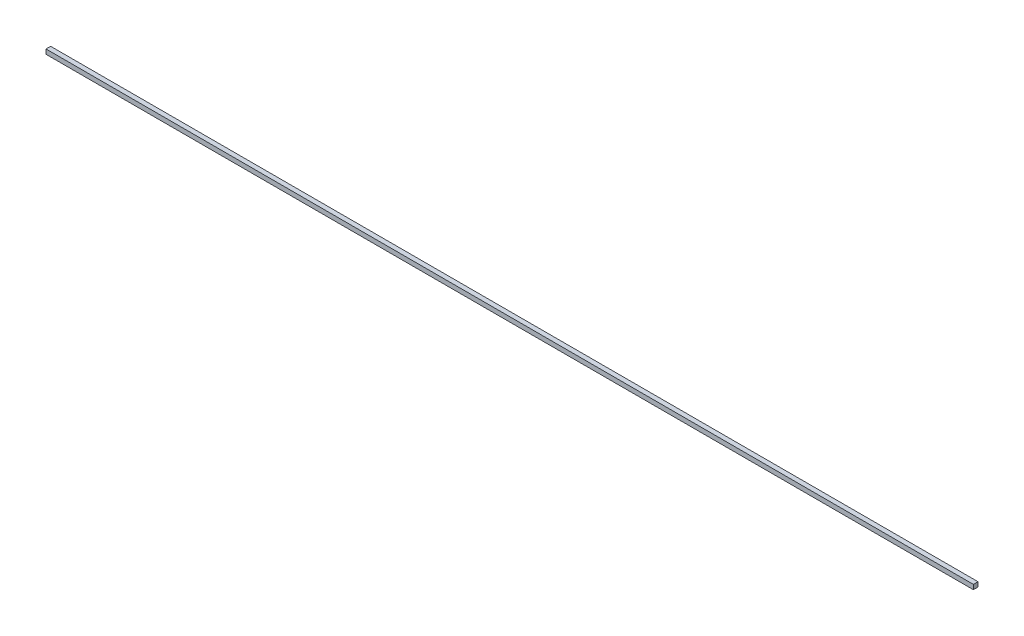
ISO-10303-21;
HEADER;
FILE_DESCRIPTION(('STEP AP214'),'2;1');
FILE_NAME('part.step','',(''),(''),'','','');
FILE_SCHEMA(('AUTOMOTIVE_DESIGN { 1 0 10303 214 1 1 1 1 }'));
ENDSEC;
DATA;
#1=APPLICATION_CONTEXT('core data for automotive mechanical design processes');
#2=APPLICATION_PROTOCOL_DEFINITION('international standard','automotive_design',2000,#1);
#3=PRODUCT_CONTEXT('',#1,'mechanical');
#4=PRODUCT('Part','Part','',(#3));
#5=PRODUCT_RELATED_PRODUCT_CATEGORY('part','',(#4));
#6=PRODUCT_DEFINITION_FORMATION('','',#4);
#7=PRODUCT_DEFINITION_CONTEXT('part definition',#1,'design');
#8=PRODUCT_DEFINITION('design','',#6,#7);
#9=PRODUCT_DEFINITION_SHAPE('','',#8);
#10=(LENGTH_UNIT() NAMED_UNIT(*) SI_UNIT(.MILLI.,.METRE.));
#11=(NAMED_UNIT(*) PLANE_ANGLE_UNIT() SI_UNIT($,.RADIAN.));
#12=(NAMED_UNIT(*) SI_UNIT($,.STERADIAN.) SOLID_ANGLE_UNIT());
#13=UNCERTAINTY_MEASURE_WITH_UNIT(LENGTH_MEASURE(1.E-05),#10,'distance_accuracy_value','');
#14=(GEOMETRIC_REPRESENTATION_CONTEXT(3) GLOBAL_UNCERTAINTY_ASSIGNED_CONTEXT((#13)) GLOBAL_UNIT_ASSIGNED_CONTEXT((#10,
#11,#12)) REPRESENTATION_CONTEXT('',''));
#15=CARTESIAN_POINT('',(0.,0.,0.));
#16=DIRECTION('',(0.,0.,1.));
#17=DIRECTION('',(1.,0.,0.));
#18=AXIS2_PLACEMENT_3D('',#15,#16,#17);
#19=CARTESIAN_POINT('',(0.,0.,3.));
#20=DIRECTION('',(0.,0.,1.));
#21=DIRECTION('',(1.,0.,0.));
#22=AXIS2_PLACEMENT_3D('',#19,#20,#21);
#23=PLANE('',#22);
#24=DIRECTION('',(0.,1.,0.));
#25=VECTOR('',#24,1.);
#26=CARTESIAN_POINT('',(-300.,0.,3.));
#27=LINE('',#26,#25);
#28=CARTESIAN_POINT('',(-300.,-50.,3.));
#29=VERTEX_POINT('',#28);
#30=CARTESIAN_POINT('',(-300.,-47.,3.));
#31=VERTEX_POINT('',#30);
#32=EDGE_CURVE('E84',#29,#31,#27,.T.);
#33=ORIENTED_EDGE('',*,*,#32,.F.);
#34=DIRECTION('',(1.,0.,0.));
#35=VECTOR('',#34,1.);
#36=CARTESIAN_POINT('',(-300.,-50.,3.));
#37=LINE('',#36,#35);
#38=CARTESIAN_POINT('',(300.,-50.,3.));
#39=VERTEX_POINT('',#38);
#40=EDGE_CURVE('E90',#29,#39,#37,.T.);
#41=ORIENTED_EDGE('',*,*,#40,.T.);
#42=DIRECTION('',(0.,1.,0.));
#43=VECTOR('',#42,1.);
#44=CARTESIAN_POINT('',(300.,1.71683972880179E-13,3.));
#45=LINE('',#44,#43);
#46=CARTESIAN_POINT('',(300.,-47.,3.));
#47=VERTEX_POINT('',#46);
#48=EDGE_CURVE('E75',#39,#47,#45,.T.);
#49=ORIENTED_EDGE('',*,*,#48,.T.);
#50=DIRECTION('',(-1.,0.,0.));
#51=VECTOR('',#50,1.);
#52=CARTESIAN_POINT('',(-300.,-47.,3.));
#53=LINE('',#52,#51);
#54=EDGE_CURVE('E89',#47,#31,#53,.T.);
#55=ORIENTED_EDGE('',*,*,#54,.T.);
#56=EDGE_LOOP('',(#33,#41,#49,#55));
#57=FACE_BOUND('',#56,.T.);
#58=ADVANCED_FACE('F32',(#57),#23,.T.);
#59=CARTESIAN_POINT('',(-300.,-50.,60.));
#60=DIRECTION('',(0.,1.,0.));
#61=DIRECTION('',(0.,0.,1.));
#62=AXIS2_PLACEMENT_3D('',#59,#60,#61);
#63=PLANE('',#62);
#64=ORIENTED_EDGE('',*,*,#40,.F.);
#65=DIRECTION('',(0.,0.,-1.));
#66=VECTOR('',#65,1.);
#67=CARTESIAN_POINT('',(-300.,-50.,60.));
#68=LINE('',#67,#66);
#69=CARTESIAN_POINT('',(-300.,-50.,0.));
#70=VERTEX_POINT('',#69);
#71=EDGE_CURVE('E47',#29,#70,#68,.T.);
#72=ORIENTED_EDGE('',*,*,#71,.T.);
#73=DIRECTION('',(1.,0.,0.));
#74=VECTOR('',#73,1.);
#75=CARTESIAN_POINT('',(-300.,-50.,0.));
#76=LINE('',#75,#74);
#77=CARTESIAN_POINT('',(300.,-50.,0.));
#78=VERTEX_POINT('',#77);
#79=EDGE_CURVE('E40',#70,#78,#76,.T.);
#80=ORIENTED_EDGE('',*,*,#79,.T.);
#81=DIRECTION('',(0.,0.,-1.));
#82=VECTOR('',#81,1.);
#83=CARTESIAN_POINT('',(300.,-50.,60.));
#84=LINE('',#83,#82);
#85=EDGE_CURVE('E83',#39,#78,#84,.T.);
#86=ORIENTED_EDGE('',*,*,#85,.F.);
#87=EDGE_LOOP('',(#64,#72,#80,#86));
#88=FACE_BOUND('',#87,.T.);
#89=ADVANCED_FACE('F34',(#88),#63,.F.);
#90=CARTESIAN_POINT('',(-300.,-47.,3.));
#91=DIRECTION('',(0.,-1.,0.));
#92=DIRECTION('',(0.,0.,-1.));
#93=AXIS2_PLACEMENT_3D('',#90,#91,#92);
#94=PLANE('',#93);
#95=ORIENTED_EDGE('',*,*,#54,.F.);
#96=DIRECTION('',(0.,0.,1.));
#97=VECTOR('',#96,1.);
#98=CARTESIAN_POINT('',(300.,-47.,3.));
#99=LINE('',#98,#97);
#100=CARTESIAN_POINT('',(300.,-47.,0.));
#101=VERTEX_POINT('',#100);
#102=EDGE_CURVE('E72',#101,#47,#99,.T.);
#103=ORIENTED_EDGE('',*,*,#102,.F.);
#104=DIRECTION('',(-1.,0.,0.));
#105=VECTOR('',#104,1.);
#106=CARTESIAN_POINT('',(300.,-47.,0.));
#107=LINE('',#106,#105);
#108=CARTESIAN_POINT('',(-300.,-47.,0.));
#109=VERTEX_POINT('',#108);
#110=EDGE_CURVE('E97',#101,#109,#107,.T.);
#111=ORIENTED_EDGE('',*,*,#110,.T.);
#112=DIRECTION('',(0.,0.,1.));
#113=VECTOR('',#112,1.);
#114=CARTESIAN_POINT('',(-300.,-47.,3.));
#115=LINE('',#114,#113);
#116=EDGE_CURVE('E11',#109,#31,#115,.T.);
#117=ORIENTED_EDGE('',*,*,#116,.T.);
#118=EDGE_LOOP('',(#95,#103,#111,#117));
#119=FACE_BOUND('',#118,.T.);
#120=ADVANCED_FACE('F92',(#119),#94,.F.);
#121=CARTESIAN_POINT('',(-300.,0.,0.));
#122=DIRECTION('',(0.,0.,1.));
#123=DIRECTION('',(1.,0.,0.));
#124=AXIS2_PLACEMENT_3D('',#121,#122,#123);
#125=PLANE('',#124);
#126=DIRECTION('',(0.,-1.,0.));
#127=VECTOR('',#126,1.);
#128=CARTESIAN_POINT('',(-300.,0.,0.));
#129=LINE('',#128,#127);
#130=EDGE_CURVE('E96',#109,#70,#129,.T.);
#131=ORIENTED_EDGE('',*,*,#130,.F.);
#132=ORIENTED_EDGE('',*,*,#110,.F.);
#133=DIRECTION('',(0.,-1.,0.));
#134=VECTOR('',#133,1.);
#135=CARTESIAN_POINT('',(300.,3.43367945760358E-13,0.));
#136=LINE('',#135,#134);
#137=EDGE_CURVE('E78',#101,#78,#136,.T.);
#138=ORIENTED_EDGE('',*,*,#137,.T.);
#139=ORIENTED_EDGE('',*,*,#79,.F.);
#140=EDGE_LOOP('',(#131,#132,#138,#139));
#141=FACE_BOUND('',#140,.T.);
#142=ADVANCED_FACE('F106',(#141),#125,.F.);
#143=CARTESIAN_POINT('',(-300.,0.,0.));
#144=DIRECTION('',(-1.,0.,0.));
#145=DIRECTION('',(0.,0.,1.));
#146=AXIS2_PLACEMENT_3D('',#143,#144,#145);
#147=PLANE('',#146);
#148=ORIENTED_EDGE('',*,*,#71,.F.);
#149=ORIENTED_EDGE('',*,*,#32,.T.);
#150=ORIENTED_EDGE('',*,*,#116,.F.);
#151=ORIENTED_EDGE('',*,*,#130,.T.);
#152=EDGE_LOOP('',(#148,#149,#150,#151));
#153=FACE_BOUND('',#152,.T.);
#154=ADVANCED_FACE('F103',(#153),#147,.T.);
#155=CARTESIAN_POINT('',(300.,1.71683972880179E-13,0.));
#156=DIRECTION('',(-1.,0.,0.));
#157=DIRECTION('',(0.,-1.,0.));
#158=AXIS2_PLACEMENT_3D('',#155,#156,#157);
#159=PLANE('',#158);
#160=ORIENTED_EDGE('',*,*,#48,.F.);
#161=ORIENTED_EDGE('',*,*,#85,.T.);
#162=ORIENTED_EDGE('',*,*,#137,.F.);
#163=ORIENTED_EDGE('',*,*,#102,.T.);
#164=EDGE_LOOP('',(#160,#161,#162,#163));
#165=FACE_BOUND('',#164,.T.);
#166=ADVANCED_FACE('F74',(#165),#159,.F.);
#167=CLOSED_SHELL('',(#58,#89,#120,#142,#154,#166));
#168=MANIFOLD_SOLID_BREP('B2',#167);
#169=ADVANCED_BREP_SHAPE_REPRESENTATION('',(#18,#168),#14);
#170=SHAPE_DEFINITION_REPRESENTATION(#9,#169);
ENDSEC;
END-ISO-10303-21;
